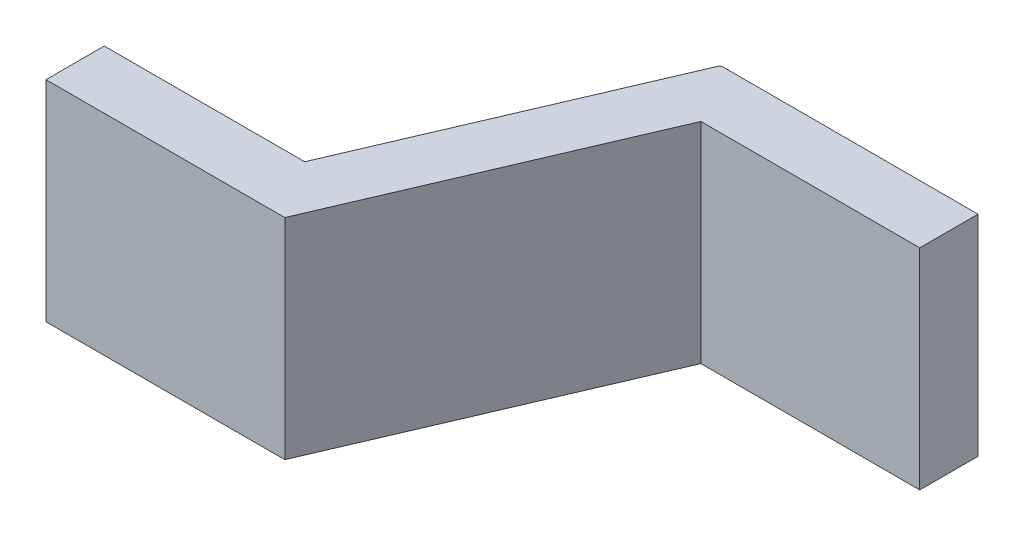
ISO-10303-21;
HEADER;
FILE_DESCRIPTION(('STEP AP214'),'2;1');
FILE_NAME('part.step','',(''),(''),'','','');
FILE_SCHEMA(('AUTOMOTIVE_DESIGN { 1 0 10303 214 1 1 1 1 }'));
ENDSEC;
DATA;
#1=APPLICATION_CONTEXT('core data for automotive mechanical design processes');
#2=APPLICATION_PROTOCOL_DEFINITION('international standard','automotive_design',2000,#1);
#3=PRODUCT_CONTEXT('',#1,'mechanical');
#4=PRODUCT('Part','Part','',(#3));
#5=PRODUCT_RELATED_PRODUCT_CATEGORY('part','',(#4));
#6=PRODUCT_DEFINITION_FORMATION('','',#4);
#7=PRODUCT_DEFINITION_CONTEXT('part definition',#1,'design');
#8=PRODUCT_DEFINITION('design','',#6,#7);
#9=PRODUCT_DEFINITION_SHAPE('','',#8);
#10=(LENGTH_UNIT() NAMED_UNIT(*) SI_UNIT(.MILLI.,.METRE.));
#11=(NAMED_UNIT(*) PLANE_ANGLE_UNIT() SI_UNIT($,.RADIAN.));
#12=(NAMED_UNIT(*) SI_UNIT($,.STERADIAN.) SOLID_ANGLE_UNIT());
#13=UNCERTAINTY_MEASURE_WITH_UNIT(LENGTH_MEASURE(1.E-05),#10,'distance_accuracy_value','');
#14=(GEOMETRIC_REPRESENTATION_CONTEXT(3) GLOBAL_UNCERTAINTY_ASSIGNED_CONTEXT((#13)) GLOBAL_UNIT_ASSIGNED_CONTEXT((#10,
#11,#12)) REPRESENTATION_CONTEXT('',''));
#15=CARTESIAN_POINT('',(0.,0.,0.));
#16=DIRECTION('',(0.,0.,1.));
#17=DIRECTION('',(1.,0.,0.));
#18=AXIS2_PLACEMENT_3D('',#15,#16,#17);
#19=CARTESIAN_POINT('',(11.558086453539,7.42,0.0006058345056003));
#20=DIRECTION('',(-0.919135450912914,0.,-0.393941649073963));
#21=DIRECTION('',(-0.393941649073963,0.,0.919135450912914));
#22=AXIS2_PLACEMENT_3D('',#19,#20,#21);
#23=PLANE('',#22);
#24=DIRECTION('',(0.,1.,0.));
#25=VECTOR('',#24,1.);
#26=CARTESIAN_POINT('',(11.344046008361,7.42,0.5));
#27=LINE('',#26,#25);
#28=CARTESIAN_POINT('',(11.344046008361,7.42,0.5));
#29=VERTEX_POINT('',#28);
#30=CARTESIAN_POINT('',(11.344046008361,7.780000014305,0.5));
#31=VERTEX_POINT('',#30);
#32=EDGE_CURVE('E94',#29,#31,#27,.T.);
#33=ORIENTED_EDGE('',*,*,#32,.T.);
#34=DIRECTION('',(-0.393941649073123,0.,0.919135450913275));
#35=VECTOR('',#34,1.);
#36=CARTESIAN_POINT('',(11.558086453539,7.780000014305,0.000605834505600302));
#37=LINE('',#36,#35);
#38=CARTESIAN_POINT('',(11.558086453539,7.780000014305,0.000605834505577237));
#39=VERTEX_POINT('',#38);
#40=EDGE_CURVE('E121',#39,#31,#37,.T.);
#41=ORIENTED_EDGE('',*,*,#40,.F.);
#42=DIRECTION('',(0.,1.,0.));
#43=VECTOR('',#42,1.);
#44=CARTESIAN_POINT('',(11.558086453539,7.42,0.000605834505554305));
#45=LINE('',#44,#43);
#46=CARTESIAN_POINT('',(11.558086453539,7.42,0.000605834505584969));
#47=VERTEX_POINT('',#46);
#48=EDGE_CURVE('E110',#39,#47,#45,.F.);
#49=ORIENTED_EDGE('',*,*,#48,.T.);
#50=DIRECTION('',(-0.393941649073123,0.,0.919135450913275));
#51=VECTOR('',#50,1.);
#52=CARTESIAN_POINT('',(11.558086453539,7.42,0.000605834505600302));
#53=LINE('',#52,#51);
#54=EDGE_CURVE('E100',#47,#29,#53,.T.);
#55=ORIENTED_EDGE('',*,*,#54,.T.);
#56=EDGE_LOOP('',(#33,#41,#49,#55));
#57=FACE_BOUND('',#56,.T.);
#58=ADVANCED_FACE('F17',(#57),#23,.T.);
#59=CARTESIAN_POINT('',(11.,7.42,0.5));
#60=DIRECTION('',(0.,0.,1.));
#61=DIRECTION('',(1.,0.,0.));
#62=AXIS2_PLACEMENT_3D('',#59,#60,#61);
#63=PLANE('',#62);
#64=DIRECTION('',(1.,0.,0.));
#65=VECTOR('',#64,1.);
#66=CARTESIAN_POINT('',(11.65,7.780000014305,0.5));
#67=LINE('',#66,#65);
#68=CARTESIAN_POINT('',(11.,7.780000014305,0.5));
#69=VERTEX_POINT('',#68);
#70=EDGE_CURVE('E79',#31,#69,#67,.F.);
#71=ORIENTED_EDGE('',*,*,#70,.F.);
#72=ORIENTED_EDGE('',*,*,#32,.F.);
#73=DIRECTION('',(1.,0.,0.));
#74=VECTOR('',#73,1.);
#75=CARTESIAN_POINT('',(11.65,7.42,0.5));
#76=LINE('',#75,#74);
#77=CARTESIAN_POINT('',(11.,7.42,0.5));
#78=VERTEX_POINT('',#77);
#79=EDGE_CURVE('E169',#29,#78,#76,.F.);
#80=ORIENTED_EDGE('',*,*,#79,.T.);
#81=DIRECTION('',(0.,1.,0.));
#82=VECTOR('',#81,1.);
#83=CARTESIAN_POINT('',(11.,7.42,0.5));
#84=LINE('',#83,#82);
#85=EDGE_CURVE('E87',#78,#69,#84,.T.);
#86=ORIENTED_EDGE('',*,*,#85,.T.);
#87=EDGE_LOOP('',(#71,#72,#80,#86));
#88=FACE_BOUND('',#87,.T.);
#89=ADVANCED_FACE('F198',(#88),#63,.F.);
#90=CARTESIAN_POINT('',(11.,7.42,0.5));
#91=DIRECTION('',(1.,0.,0.));
#92=DIRECTION('',(0.,0.,-1.));
#93=AXIS2_PLACEMENT_3D('',#90,#91,#92);
#94=PLANE('',#93);
#95=ORIENTED_EDGE('',*,*,#85,.F.);
#96=DIRECTION('',(0.,0.,1.));
#97=VECTOR('',#96,1.);
#98=CARTESIAN_POINT('',(11.,7.42,0.04));
#99=LINE('',#98,#97);
#100=CARTESIAN_POINT('',(11.,7.42,0.60000000149));
#101=VERTEX_POINT('',#100);
#102=EDGE_CURVE('E153',#78,#101,#99,.T.);
#103=ORIENTED_EDGE('',*,*,#102,.T.);
#104=DIRECTION('',(0.,1.,0.));
#105=VECTOR('',#104,1.);
#106=CARTESIAN_POINT('',(11.,7.42,0.60000000149));
#107=LINE('',#106,#105);
#108=CARTESIAN_POINT('',(11.,7.780000014305,0.60000000149));
#109=VERTEX_POINT('',#108);
#110=EDGE_CURVE('E117',#109,#101,#107,.F.);
#111=ORIENTED_EDGE('',*,*,#110,.F.);
#112=DIRECTION('',(0.,0.,1.));
#113=VECTOR('',#112,1.);
#114=CARTESIAN_POINT('',(11.,7.780000014305,0.04));
#115=LINE('',#114,#113);
#116=EDGE_CURVE('E71',#69,#109,#115,.T.);
#117=ORIENTED_EDGE('',*,*,#116,.F.);
#118=EDGE_LOOP('',(#95,#103,#111,#117));
#119=FACE_BOUND('',#118,.T.);
#120=ADVANCED_FACE('F202',(#119),#94,.F.);
#121=CARTESIAN_POINT('',(11.999999997616,7.42,0.));
#122=DIRECTION('',(1.,0.,0.));
#123=DIRECTION('',(0.,0.,-1.));
#124=AXIS2_PLACEMENT_3D('',#121,#122,#123);
#125=PLANE('',#124);
#126=DIRECTION('',(0.,0.,1.));
#127=VECTOR('',#126,1.);
#128=CARTESIAN_POINT('',(11.999999997616,7.42,0.04));
#129=LINE('',#128,#127);
#130=CARTESIAN_POINT('',(11.999999997616,7.42,0.10000000149));
#131=VERTEX_POINT('',#130);
#132=CARTESIAN_POINT('',(11.999999997616,7.42,0.));
#133=VERTEX_POINT('',#132);
#134=EDGE_CURVE('E179',#131,#133,#129,.F.);
#135=ORIENTED_EDGE('',*,*,#134,.T.);
#136=DIRECTION('',(0.,1.,0.));
#137=VECTOR('',#136,1.);
#138=CARTESIAN_POINT('',(11.999999997616,7.42,0.));
#139=LINE('',#138,#137);
#140=CARTESIAN_POINT('',(11.999999997616,7.780000014305,0.));
#141=VERTEX_POINT('',#140);
#142=EDGE_CURVE('E174',#133,#141,#139,.T.);
#143=ORIENTED_EDGE('',*,*,#142,.T.);
#144=DIRECTION('',(0.,0.,1.));
#145=VECTOR('',#144,1.);
#146=CARTESIAN_POINT('',(11.999999997616,7.780000014305,0.04));
#147=LINE('',#146,#145);
#148=CARTESIAN_POINT('',(11.999999997616,7.780000014305,0.10000000149));
#149=VERTEX_POINT('',#148);
#150=EDGE_CURVE('E155',#149,#141,#147,.F.);
#151=ORIENTED_EDGE('',*,*,#150,.F.);
#152=DIRECTION('',(0.,1.,0.));
#153=VECTOR('',#152,1.);
#154=CARTESIAN_POINT('',(11.999999997616,7.42,0.10000000149));
#155=LINE('',#154,#153);
#156=EDGE_CURVE('E125',#131,#149,#155,.T.);
#157=ORIENTED_EDGE('',*,*,#156,.F.);
#158=EDGE_LOOP('',(#135,#143,#151,#157));
#159=FACE_BOUND('',#158,.T.);
#160=ADVANCED_FACE('F228',(#159),#125,.T.);
#161=CARTESIAN_POINT('',(11.56,7.42,0.));
#162=DIRECTION('',(0.,0.,1.));
#163=DIRECTION('',(1.,0.,0.));
#164=AXIS2_PLACEMENT_3D('',#161,#162,#163);
#165=PLANE('',#164);
#166=DIRECTION('',(1.,0.,0.));
#167=VECTOR('',#166,1.);
#168=CARTESIAN_POINT('',(11.65,7.42,0.));
#169=LINE('',#168,#167);
#170=CARTESIAN_POINT('',(11.56,7.42,0.));
#171=VERTEX_POINT('',#170);
#172=EDGE_CURVE('E150',#133,#171,#169,.F.);
#173=ORIENTED_EDGE('',*,*,#172,.T.);
#174=DIRECTION('',(0.,1.,0.));
#175=VECTOR('',#174,1.);
#176=CARTESIAN_POINT('',(11.56,7.42,0.));
#177=LINE('',#176,#175);
#178=CARTESIAN_POINT('',(11.56,7.780000014305,0.));
#179=VERTEX_POINT('',#178);
#180=EDGE_CURVE('E164',#171,#179,#177,.T.);
#181=ORIENTED_EDGE('',*,*,#180,.T.);
#182=DIRECTION('',(1.,0.,0.));
#183=VECTOR('',#182,1.);
#184=CARTESIAN_POINT('',(11.65,7.780000014305,0.));
#185=LINE('',#184,#183);
#186=EDGE_CURVE('E154',#141,#179,#185,.F.);
#187=ORIENTED_EDGE('',*,*,#186,.F.);
#188=ORIENTED_EDGE('',*,*,#142,.F.);
#189=EDGE_LOOP('',(#173,#181,#187,#188));
#190=FACE_BOUND('',#189,.T.);
#191=ADVANCED_FACE('F232',(#190),#165,.F.);
#192=CARTESIAN_POINT('',(11.56,7.42,0.));
#193=DIRECTION('',(1.,0.,0.));
#194=DIRECTION('',(0.,0.,-1.));
#195=AXIS2_PLACEMENT_3D('',#192,#193,#194);
#196=PLANE('',#195);
#197=DIRECTION('',(0.,1.,0.));
#198=VECTOR('',#197,1.);
#199=CARTESIAN_POINT('',(11.56,7.42,0.00142598092431268));
#200=LINE('',#199,#198);
#201=CARTESIAN_POINT('',(11.56,7.42,0.00142598092431734));
#202=VERTEX_POINT('',#201);
#203=CARTESIAN_POINT('',(11.56,7.780000014305,0.00142598092431734));
#204=VERTEX_POINT('',#203);
#205=EDGE_CURVE('E118',#202,#204,#200,.T.);
#206=ORIENTED_EDGE('',*,*,#205,.T.);
#207=DIRECTION('',(0.,0.,1.));
#208=VECTOR('',#207,1.);
#209=CARTESIAN_POINT('',(11.56,7.780000014305,0.04));
#210=LINE('',#209,#208);
#211=EDGE_CURVE('E123',#179,#204,#210,.T.);
#212=ORIENTED_EDGE('',*,*,#211,.F.);
#213=ORIENTED_EDGE('',*,*,#180,.F.);
#214=DIRECTION('',(0.,0.,-1.));
#215=VECTOR('',#214,1.);
#216=CARTESIAN_POINT('',(11.56,7.42,0.));
#217=LINE('',#216,#215);
#218=EDGE_CURVE('E147',#171,#202,#217,.F.);
#219=ORIENTED_EDGE('',*,*,#218,.T.);
#220=EDGE_LOOP('',(#206,#212,#213,#219));
#221=FACE_BOUND('',#220,.T.);
#222=ADVANCED_FACE('F234',(#221),#196,.F.);
#223=CARTESIAN_POINT('',(11.65,7.42,0.04));
#224=DIRECTION('',(-0.393941649073963,0.,0.919135450912914));
#225=DIRECTION('',(0.919135450912914,0.,0.393941649073963));
#226=AXIS2_PLACEMENT_3D('',#223,#224,#225);
#227=PLANE('',#226);
#228=DIRECTION('',(-0.919135450920459,0.,-0.393941649056361));
#229=VECTOR('',#228,1.);
#230=CARTESIAN_POINT('',(11.56,7.780000014305,0.001425980924322));
#231=LINE('',#230,#229);
#232=EDGE_CURVE('E113',#204,#39,#231,.T.);
#233=ORIENTED_EDGE('',*,*,#232,.F.);
#234=ORIENTED_EDGE('',*,*,#205,.F.);
#235=DIRECTION('',(-0.919135450920459,0.,-0.393941649056361));
#236=VECTOR('',#235,1.);
#237=CARTESIAN_POINT('',(11.56,7.42,0.001425980924322));
#238=LINE('',#237,#236);
#239=EDGE_CURVE('E114',#202,#47,#238,.T.);
#240=ORIENTED_EDGE('',*,*,#239,.T.);
#241=ORIENTED_EDGE('',*,*,#48,.F.);
#242=EDGE_LOOP('',(#233,#234,#240,#241));
#243=FACE_BOUND('',#242,.T.);
#244=ADVANCED_FACE('F112',(#243),#227,.F.);
#245=CARTESIAN_POINT('',(11.,7.42,0.60000000149));
#246=DIRECTION('',(0.,0.,1.));
#247=DIRECTION('',(1.,0.,0.));
#248=AXIS2_PLACEMENT_3D('',#245,#246,#247);
#249=PLANE('',#248);
#250=DIRECTION('',(0.,1.,0.));
#251=VECTOR('',#250,1.);
#252=CARTESIAN_POINT('',(11.4099838806682,7.42,0.60000000149));
#253=LINE('',#252,#251);
#254=CARTESIAN_POINT('',(11.4099838806682,7.42,0.60000000149));
#255=VERTEX_POINT('',#254);
#256=CARTESIAN_POINT('',(11.4099838806682,7.780000014305,0.60000000149));
#257=VERTEX_POINT('',#256);
#258=EDGE_CURVE('E144',#255,#257,#253,.T.);
#259=ORIENTED_EDGE('',*,*,#258,.T.);
#260=DIRECTION('',(1.,0.,0.));
#261=VECTOR('',#260,1.);
#262=CARTESIAN_POINT('',(11.65,7.780000014305,0.60000000149));
#263=LINE('',#262,#261);
#264=EDGE_CURVE('E20',#109,#257,#263,.T.);
#265=ORIENTED_EDGE('',*,*,#264,.F.);
#266=ORIENTED_EDGE('',*,*,#110,.T.);
#267=DIRECTION('',(1.,0.,0.));
#268=VECTOR('',#267,1.);
#269=CARTESIAN_POINT('',(11.,7.42,0.60000000149));
#270=LINE('',#269,#268);
#271=EDGE_CURVE('E151',#101,#255,#270,.T.);
#272=ORIENTED_EDGE('',*,*,#271,.T.);
#273=EDGE_LOOP('',(#259,#265,#266,#272));
#274=FACE_BOUND('',#273,.T.);
#275=ADVANCED_FACE('F205',(#274),#249,.T.);
#276=CARTESIAN_POINT('',(11.65,7.780000014305,0.04));
#277=DIRECTION('',(0.,1.,0.));
#278=DIRECTION('',(0.,0.,1.));
#279=AXIS2_PLACEMENT_3D('',#276,#277,#278);
#280=PLANE('',#279);
#281=ORIENTED_EDGE('',*,*,#211,.T.);
#282=ORIENTED_EDGE('',*,*,#232,.T.);
#283=ORIENTED_EDGE('',*,*,#40,.T.);
#284=ORIENTED_EDGE('',*,*,#70,.T.);
#285=ORIENTED_EDGE('',*,*,#116,.T.);
#286=ORIENTED_EDGE('',*,*,#264,.T.);
#287=DIRECTION('',(-0.393941649073964,0.,0.919135450912914));
#288=VECTOR('',#287,1.);
#289=CARTESIAN_POINT('',(11.6242839866442,7.780000014305,0.100000001490094));
#290=LINE('',#289,#288);
#291=CARTESIAN_POINT('',(11.6242839866442,7.780000014305,0.100000001490047));
#292=VERTEX_POINT('',#291);
#293=EDGE_CURVE('E141',#257,#292,#290,.F.);
#294=ORIENTED_EDGE('',*,*,#293,.T.);
#295=DIRECTION('',(1.,0.,0.));
#296=VECTOR('',#295,1.);
#297=CARTESIAN_POINT('',(11.56,7.780000014305,0.10000000149));
#298=LINE('',#297,#296);
#299=EDGE_CURVE('E170',#149,#292,#298,.F.);
#300=ORIENTED_EDGE('',*,*,#299,.F.);
#301=ORIENTED_EDGE('',*,*,#150,.T.);
#302=ORIENTED_EDGE('',*,*,#186,.T.);
#303=EDGE_LOOP('',(#281,#282,#283,#284,#285,#286,#294,#300,#301,#302));
#304=FACE_BOUND('',#303,.T.);
#305=ADVANCED_FACE('F120',(#304),#280,.T.);
#306=CARTESIAN_POINT('',(11.56,7.42,0.10000000149));
#307=DIRECTION('',(0.,0.,1.));
#308=DIRECTION('',(1.,0.,0.));
#309=AXIS2_PLACEMENT_3D('',#306,#307,#308);
#310=PLANE('',#309);
#311=ORIENTED_EDGE('',*,*,#299,.T.);
#312=DIRECTION('',(0.,1.,0.));
#313=VECTOR('',#312,1.);
#314=CARTESIAN_POINT('',(11.6242839866442,7.42,0.100000001490094));
#315=LINE('',#314,#313);
#316=CARTESIAN_POINT('',(11.6242839866442,7.42,0.100000001490047));
#317=VERTEX_POINT('',#316);
#318=EDGE_CURVE('E26',#292,#317,#315,.F.);
#319=ORIENTED_EDGE('',*,*,#318,.T.);
#320=DIRECTION('',(1.,0.,0.));
#321=VECTOR('',#320,1.);
#322=CARTESIAN_POINT('',(11.65,7.42,0.10000000149));
#323=LINE('',#322,#321);
#324=EDGE_CURVE('E34',#317,#131,#323,.T.);
#325=ORIENTED_EDGE('',*,*,#324,.T.);
#326=ORIENTED_EDGE('',*,*,#156,.T.);
#327=EDGE_LOOP('',(#311,#319,#325,#326));
#328=FACE_BOUND('',#327,.T.);
#329=ADVANCED_FACE('F223',(#328),#310,.T.);
#330=CARTESIAN_POINT('',(11.65,7.42,0.04));
#331=DIRECTION('',(0.,1.,0.));
#332=DIRECTION('',(0.,0.,1.));
#333=AXIS2_PLACEMENT_3D('',#330,#331,#332);
#334=PLANE('',#333);
#335=ORIENTED_EDGE('',*,*,#218,.F.);
#336=ORIENTED_EDGE('',*,*,#172,.F.);
#337=ORIENTED_EDGE('',*,*,#134,.F.);
#338=ORIENTED_EDGE('',*,*,#324,.F.);
#339=DIRECTION('',(0.393941649073964,0.,-0.919135450912914));
#340=VECTOR('',#339,1.);
#341=CARTESIAN_POINT('',(11.4098164411035,7.42,0.600390667570103));
#342=LINE('',#341,#340);
#343=EDGE_CURVE('E11',#317,#255,#342,.F.);
#344=ORIENTED_EDGE('',*,*,#343,.T.);
#345=ORIENTED_EDGE('',*,*,#271,.F.);
#346=ORIENTED_EDGE('',*,*,#102,.F.);
#347=ORIENTED_EDGE('',*,*,#79,.F.);
#348=ORIENTED_EDGE('',*,*,#54,.F.);
#349=ORIENTED_EDGE('',*,*,#239,.F.);
#350=EDGE_LOOP('',(#335,#336,#337,#338,#344,#345,#346,#347,#348,#349));
#351=FACE_BOUND('',#350,.T.);
#352=ADVANCED_FACE('F200',(#351),#334,.F.);
#353=CARTESIAN_POINT('',(11.65,7.42,0.04));
#354=DIRECTION('',(-0.919135450912914,0.,-0.393941649073963));
#355=DIRECTION('',(-0.393941649073963,0.,0.919135450912914));
#356=AXIS2_PLACEMENT_3D('',#353,#354,#355);
#357=PLANE('',#356);
#358=ORIENTED_EDGE('',*,*,#318,.F.);
#359=ORIENTED_EDGE('',*,*,#293,.F.);
#360=ORIENTED_EDGE('',*,*,#258,.F.);
#361=ORIENTED_EDGE('',*,*,#343,.F.);
#362=EDGE_LOOP('',(#358,#359,#360,#361));
#363=FACE_BOUND('',#362,.T.);
#364=ADVANCED_FACE('F210',(#363),#357,.F.);
#365=CLOSED_SHELL('',(#58,#89,#120,#160,#191,#222,#244,#275,#305,#329,#352,#364));
#366=MANIFOLD_SOLID_BREP('B1',#365);
#367=ADVANCED_BREP_SHAPE_REPRESENTATION('',(#18,#366),#14);
#368=SHAPE_DEFINITION_REPRESENTATION(#9,#367);
ENDSEC;
END-ISO-10303-21;
